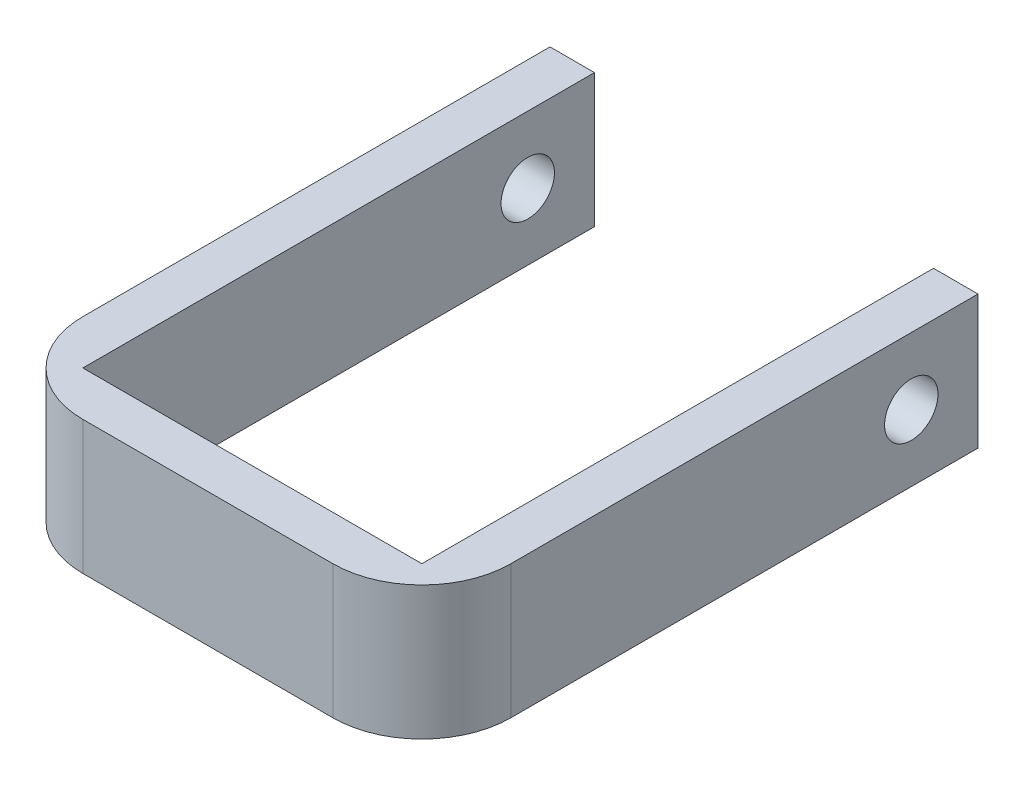
ISO-10303-21;
HEADER;
FILE_DESCRIPTION(('STEP AP214'),'2;1');
FILE_NAME('part.step','',(''),(''),'','','');
FILE_SCHEMA(('AUTOMOTIVE_DESIGN { 1 0 10303 214 1 1 1 1 }'));
ENDSEC;
DATA;
#1=APPLICATION_CONTEXT('core data for automotive mechanical design processes');
#2=APPLICATION_PROTOCOL_DEFINITION('international standard','automotive_design',2000,#1);
#3=PRODUCT_CONTEXT('',#1,'mechanical');
#4=PRODUCT('Part','Part','',(#3));
#5=PRODUCT_RELATED_PRODUCT_CATEGORY('part','',(#4));
#6=PRODUCT_DEFINITION_FORMATION('','',#4);
#7=PRODUCT_DEFINITION_CONTEXT('part definition',#1,'design');
#8=PRODUCT_DEFINITION('design','',#6,#7);
#9=PRODUCT_DEFINITION_SHAPE('','',#8);
#10=(LENGTH_UNIT() NAMED_UNIT(*) SI_UNIT(.MILLI.,.METRE.));
#11=(NAMED_UNIT(*) PLANE_ANGLE_UNIT() SI_UNIT($,.RADIAN.));
#12=(NAMED_UNIT(*) SI_UNIT($,.STERADIAN.) SOLID_ANGLE_UNIT());
#13=UNCERTAINTY_MEASURE_WITH_UNIT(LENGTH_MEASURE(1.E-05),#10,'distance_accuracy_value','');
#14=(GEOMETRIC_REPRESENTATION_CONTEXT(3) GLOBAL_UNCERTAINTY_ASSIGNED_CONTEXT((#13)) GLOBAL_UNIT_ASSIGNED_CONTEXT((#10,
#11,#12)) REPRESENTATION_CONTEXT('',''));
#15=CARTESIAN_POINT('',(0.,0.,0.));
#16=DIRECTION('',(0.,0.,1.));
#17=DIRECTION('',(1.,0.,0.));
#18=AXIS2_PLACEMENT_3D('',#15,#16,#17);
#19=CARTESIAN_POINT('',(0.,30.,0.));
#20=DIRECTION('',(-1.,0.,0.));
#21=DIRECTION('',(0.,0.,1.));
#22=AXIS2_PLACEMENT_3D('',#19,#20,#21);
#23=PLANE('',#22);
#24=CARTESIAN_POINT('',(0.,15.,-100.));
#25=DIRECTION('',(-1.,0.,0.));
#26=DIRECTION('',(0.,0.,1.));
#27=AXIS2_PLACEMENT_3D('',#24,#25,#26);
#28=CIRCLE('',#27,6.);
#29=CARTESIAN_POINT('',(0.,15.,-94.));
#30=VERTEX_POINT('',#29);
#31=EDGE_CURVE('E226',#30,#30,#28,.T.);
#32=ORIENTED_EDGE('',*,*,#31,.T.);
#33=EDGE_LOOP('',(#32));
#34=FACE_BOUND('',#33,.T.);
#35=DIRECTION('',(0.,0.,-1.));
#36=VECTOR('',#35,1.);
#37=CARTESIAN_POINT('',(0.,0.,0.));
#38=LINE('',#37,#36);
#39=CARTESIAN_POINT('',(0.,0.,0.));
#40=VERTEX_POINT('',#39);
#41=CARTESIAN_POINT('',(0.,0.,-115.));
#42=VERTEX_POINT('',#41);
#43=EDGE_CURVE('E149',#40,#42,#38,.T.);
#44=ORIENTED_EDGE('',*,*,#43,.T.);
#45=DIRECTION('',(0.,-1.,0.));
#46=VECTOR('',#45,1.);
#47=CARTESIAN_POINT('',(0.,30.,-115.));
#48=LINE('',#47,#46);
#49=CARTESIAN_POINT('',(0.,30.,-115.));
#50=VERTEX_POINT('',#49);
#51=EDGE_CURVE('E131',#50,#42,#48,.T.);
#52=ORIENTED_EDGE('',*,*,#51,.F.);
#53=DIRECTION('',(0.,0.,-1.));
#54=VECTOR('',#53,1.);
#55=CARTESIAN_POINT('',(0.,30.,0.));
#56=LINE('',#55,#54);
#57=CARTESIAN_POINT('',(0.,30.,0.));
#58=VERTEX_POINT('',#57);
#59=EDGE_CURVE('E137',#58,#50,#56,.T.);
#60=ORIENTED_EDGE('',*,*,#59,.F.);
#61=DIRECTION('',(0.,-1.,0.));
#62=VECTOR('',#61,1.);
#63=CARTESIAN_POINT('',(0.,30.,0.));
#64=LINE('',#63,#62);
#65=EDGE_CURVE('E203',#58,#40,#64,.T.);
#66=ORIENTED_EDGE('',*,*,#65,.T.);
#67=EDGE_LOOP('',(#44,#52,#60,#66));
#68=FACE_BOUND('',#67,.T.);
#69=ADVANCED_FACE('F47',(#34,#68),#23,.F.);
#70=CARTESIAN_POINT('',(0.,30.,-115.));
#71=DIRECTION('',(0.,0.,1.));
#72=DIRECTION('',(1.,0.,0.));
#73=AXIS2_PLACEMENT_3D('',#70,#71,#72);
#74=PLANE('',#73);
#75=DIRECTION('',(-1.,0.,0.));
#76=VECTOR('',#75,1.);
#77=CARTESIAN_POINT('',(0.,0.,-115.));
#78=LINE('',#77,#76);
#79=CARTESIAN_POINT('',(-10.,0.,-115.));
#80=VERTEX_POINT('',#79);
#81=EDGE_CURVE('E195',#42,#80,#78,.T.);
#82=ORIENTED_EDGE('',*,*,#81,.T.);
#83=DIRECTION('',(0.,-1.,0.));
#84=VECTOR('',#83,1.);
#85=CARTESIAN_POINT('',(-10.,30.,-115.));
#86=LINE('',#85,#84);
#87=CARTESIAN_POINT('',(-10.,30.,-115.));
#88=VERTEX_POINT('',#87);
#89=EDGE_CURVE('E134',#88,#80,#86,.T.);
#90=ORIENTED_EDGE('',*,*,#89,.F.);
#91=DIRECTION('',(-1.,0.,0.));
#92=VECTOR('',#91,1.);
#93=CARTESIAN_POINT('',(0.,30.,-115.));
#94=LINE('',#93,#92);
#95=EDGE_CURVE('E127',#50,#88,#94,.T.);
#96=ORIENTED_EDGE('',*,*,#95,.F.);
#97=ORIENTED_EDGE('',*,*,#51,.T.);
#98=EDGE_LOOP('',(#82,#90,#96,#97));
#99=FACE_BOUND('',#98,.T.);
#100=ADVANCED_FACE('F129',(#99),#74,.F.);
#101=CARTESIAN_POINT('',(-10.,30.,-115.));
#102=DIRECTION('',(1.,0.,0.));
#103=DIRECTION('',(0.,0.,-1.));
#104=AXIS2_PLACEMENT_3D('',#101,#102,#103);
#105=PLANE('',#104);
#106=CARTESIAN_POINT('',(-9.99999999999999,15.,-100.));
#107=DIRECTION('',(1.,0.,0.));
#108=DIRECTION('',(0.,0.,-1.));
#109=AXIS2_PLACEMENT_3D('',#106,#107,#108);
#110=CIRCLE('',#109,6.);
#111=CARTESIAN_POINT('',(-9.99999999999999,15.,-106.));
#112=VERTEX_POINT('',#111);
#113=EDGE_CURVE('E239',#112,#112,#110,.T.);
#114=ORIENTED_EDGE('',*,*,#113,.T.);
#115=EDGE_LOOP('',(#114));
#116=FACE_BOUND('',#115,.T.);
#117=DIRECTION('',(0.,0.,1.));
#118=VECTOR('',#117,1.);
#119=CARTESIAN_POINT('',(-10.,0.,-115.));
#120=LINE('',#119,#118);
#121=CARTESIAN_POINT('',(-9.99999999999999,0.,-9.99999999999999));
#122=VERTEX_POINT('',#121);
#123=EDGE_CURVE('E191',#80,#122,#120,.T.);
#124=ORIENTED_EDGE('',*,*,#123,.T.);
#125=DIRECTION('',(0.,-1.,0.));
#126=VECTOR('',#125,1.);
#127=CARTESIAN_POINT('',(-9.99999999999999,30.,-9.99999999999999));
#128=LINE('',#127,#126);
#129=CARTESIAN_POINT('',(-9.99999999999999,30.,-9.99999999999999));
#130=VERTEX_POINT('',#129);
#131=EDGE_CURVE('E11',#122,#130,#128,.F.);
#132=ORIENTED_EDGE('',*,*,#131,.T.);
#133=DIRECTION('',(0.,0.,1.));
#134=VECTOR('',#133,1.);
#135=CARTESIAN_POINT('',(-10.,30.,-115.));
#136=LINE('',#135,#134);
#137=EDGE_CURVE('E136',#88,#130,#136,.T.);
#138=ORIENTED_EDGE('',*,*,#137,.F.);
#139=ORIENTED_EDGE('',*,*,#89,.T.);
#140=EDGE_LOOP('',(#124,#132,#138,#139));
#141=FACE_BOUND('',#140,.T.);
#142=ADVANCED_FACE('F228',(#116,#141),#105,.F.);
#143=CARTESIAN_POINT('',(-9.99999999999999,30.,9.99999999999999));
#144=DIRECTION('',(0.,0.,-1.));
#145=DIRECTION('',(-1.,0.,0.));
#146=AXIS2_PLACEMENT_3D('',#143,#144,#145);
#147=PLANE('',#146);
#148=DIRECTION('',(1.,0.,0.));
#149=VECTOR('',#148,1.);
#150=CARTESIAN_POINT('',(-9.99999999999999,0.,9.99999999999999));
#151=LINE('',#150,#149);
#152=CARTESIAN_POINT('',(10.,0.,10.));
#153=VERTEX_POINT('',#152);
#154=CARTESIAN_POINT('',(66.2,0.,10.));
#155=VERTEX_POINT('',#154);
#156=EDGE_CURVE('E186',#153,#155,#151,.T.);
#157=ORIENTED_EDGE('',*,*,#156,.T.);
#158=DIRECTION('',(0.,-1.,0.));
#159=VECTOR('',#158,1.);
#160=CARTESIAN_POINT('',(66.2,30.,10.));
#161=LINE('',#160,#159);
#162=CARTESIAN_POINT('',(66.2,30.,10.));
#163=VERTEX_POINT('',#162);
#164=EDGE_CURVE('E69',#155,#163,#161,.F.);
#165=ORIENTED_EDGE('',*,*,#164,.T.);
#166=DIRECTION('',(1.,0.,0.));
#167=VECTOR('',#166,1.);
#168=CARTESIAN_POINT('',(-9.99999999999999,30.,9.99999999999999));
#169=LINE('',#168,#167);
#170=CARTESIAN_POINT('',(10.,30.,10.));
#171=VERTEX_POINT('',#170);
#172=EDGE_CURVE('E172',#171,#163,#169,.T.);
#173=ORIENTED_EDGE('',*,*,#172,.F.);
#174=DIRECTION('',(0.,-1.,0.));
#175=VECTOR('',#174,1.);
#176=CARTESIAN_POINT('',(10.,30.,10.));
#177=LINE('',#176,#175);
#178=EDGE_CURVE('E162',#171,#153,#177,.T.);
#179=ORIENTED_EDGE('',*,*,#178,.T.);
#180=EDGE_LOOP('',(#157,#165,#173,#179));
#181=FACE_BOUND('',#180,.T.);
#182=ADVANCED_FACE('F189',(#181),#147,.F.);
#183=CARTESIAN_POINT('',(86.2,30.,10.));
#184=DIRECTION('',(-1.,0.,0.));
#185=DIRECTION('',(0.,0.,1.));
#186=AXIS2_PLACEMENT_3D('',#183,#184,#185);
#187=PLANE('',#186);
#188=CARTESIAN_POINT('',(86.2,15.,-100.));
#189=DIRECTION('',(1.,0.,0.));
#190=DIRECTION('',(0.,0.,-1.));
#191=AXIS2_PLACEMENT_3D('',#188,#189,#190);
#192=CIRCLE('',#191,6.);
#193=CARTESIAN_POINT('',(86.2,15.,-106.));
#194=VERTEX_POINT('',#193);
#195=EDGE_CURVE('E236',#194,#194,#192,.T.);
#196=ORIENTED_EDGE('',*,*,#195,.F.);
#197=EDGE_LOOP('',(#196));
#198=FACE_BOUND('',#197,.T.);
#199=DIRECTION('',(0.,0.,-1.));
#200=VECTOR('',#199,1.);
#201=CARTESIAN_POINT('',(86.2,30.,10.));
#202=LINE('',#201,#200);
#203=CARTESIAN_POINT('',(86.2,30.,-10.));
#204=VERTEX_POINT('',#203);
#205=CARTESIAN_POINT('',(86.2,30.,-115.));
#206=VERTEX_POINT('',#205);
#207=EDGE_CURVE('E170',#204,#206,#202,.T.);
#208=ORIENTED_EDGE('',*,*,#207,.F.);
#209=DIRECTION('',(0.,-1.,0.));
#210=VECTOR('',#209,1.);
#211=CARTESIAN_POINT('',(86.2,30.,-10.));
#212=LINE('',#211,#210);
#213=CARTESIAN_POINT('',(86.2,0.,-10.));
#214=VERTEX_POINT('',#213);
#215=EDGE_CURVE('E150',#204,#214,#212,.T.);
#216=ORIENTED_EDGE('',*,*,#215,.T.);
#217=DIRECTION('',(0.,0.,-1.));
#218=VECTOR('',#217,1.);
#219=CARTESIAN_POINT('',(86.2,0.,10.));
#220=LINE('',#219,#218);
#221=CARTESIAN_POINT('',(86.2,0.,-115.));
#222=VERTEX_POINT('',#221);
#223=EDGE_CURVE('E188',#214,#222,#220,.T.);
#224=ORIENTED_EDGE('',*,*,#223,.T.);
#225=DIRECTION('',(0.,-1.,0.));
#226=VECTOR('',#225,1.);
#227=CARTESIAN_POINT('',(86.2,30.,-115.));
#228=LINE('',#227,#226);
#229=EDGE_CURVE('E155',#206,#222,#228,.T.);
#230=ORIENTED_EDGE('',*,*,#229,.F.);
#231=EDGE_LOOP('',(#208,#216,#224,#230));
#232=FACE_BOUND('',#231,.T.);
#233=ADVANCED_FACE('F176',(#198,#232),#187,.F.);
#234=CARTESIAN_POINT('',(86.2,30.,-115.));
#235=DIRECTION('',(0.,0.,1.));
#236=DIRECTION('',(1.,0.,0.));
#237=AXIS2_PLACEMENT_3D('',#234,#235,#236);
#238=PLANE('',#237);
#239=DIRECTION('',(-1.,0.,0.));
#240=VECTOR('',#239,1.);
#241=CARTESIAN_POINT('',(86.2,0.,-115.));
#242=LINE('',#241,#240);
#243=CARTESIAN_POINT('',(76.2,0.,-115.));
#244=VERTEX_POINT('',#243);
#245=EDGE_CURVE('E193',#222,#244,#242,.T.);
#246=ORIENTED_EDGE('',*,*,#245,.T.);
#247=DIRECTION('',(0.,-1.,0.));
#248=VECTOR('',#247,1.);
#249=CARTESIAN_POINT('',(76.2,30.,-115.));
#250=LINE('',#249,#248);
#251=CARTESIAN_POINT('',(76.2,30.,-115.));
#252=VERTEX_POINT('',#251);
#253=EDGE_CURVE('E208',#252,#244,#250,.T.);
#254=ORIENTED_EDGE('',*,*,#253,.F.);
#255=DIRECTION('',(-1.,0.,0.));
#256=VECTOR('',#255,1.);
#257=CARTESIAN_POINT('',(86.2,30.,-115.));
#258=LINE('',#257,#256);
#259=EDGE_CURVE('E180',#206,#252,#258,.T.);
#260=ORIENTED_EDGE('',*,*,#259,.F.);
#261=ORIENTED_EDGE('',*,*,#229,.T.);
#262=EDGE_LOOP('',(#246,#254,#260,#261));
#263=FACE_BOUND('',#262,.T.);
#264=ADVANCED_FACE('F211',(#263),#238,.F.);
#265=CARTESIAN_POINT('',(76.2,30.,0.));
#266=DIRECTION('',(1.,0.,0.));
#267=DIRECTION('',(0.,0.,-1.));
#268=AXIS2_PLACEMENT_3D('',#265,#266,#267);
#269=PLANE('',#268);
#270=CARTESIAN_POINT('',(76.2,15.,-100.));
#271=DIRECTION('',(1.,0.,0.));
#272=DIRECTION('',(0.,0.,-1.));
#273=AXIS2_PLACEMENT_3D('',#270,#271,#272);
#274=CIRCLE('',#273,6.);
#275=CARTESIAN_POINT('',(76.2,15.,-106.));
#276=VERTEX_POINT('',#275);
#277=EDGE_CURVE('E51',#276,#276,#274,.T.);
#278=ORIENTED_EDGE('',*,*,#277,.T.);
#279=EDGE_LOOP('',(#278));
#280=FACE_BOUND('',#279,.T.);
#281=DIRECTION('',(0.,0.,1.));
#282=VECTOR('',#281,1.);
#283=CARTESIAN_POINT('',(76.2,0.,0.));
#284=LINE('',#283,#282);
#285=CARTESIAN_POINT('',(76.2,0.,0.));
#286=VERTEX_POINT('',#285);
#287=EDGE_CURVE('E200',#244,#286,#284,.T.);
#288=ORIENTED_EDGE('',*,*,#287,.T.);
#289=DIRECTION('',(0.,-1.,0.));
#290=VECTOR('',#289,1.);
#291=CARTESIAN_POINT('',(76.2,30.,0.));
#292=LINE('',#291,#290);
#293=CARTESIAN_POINT('',(76.2,30.,0.));
#294=VERTEX_POINT('',#293);
#295=EDGE_CURVE('E205',#294,#286,#292,.T.);
#296=ORIENTED_EDGE('',*,*,#295,.F.);
#297=DIRECTION('',(0.,0.,1.));
#298=VECTOR('',#297,1.);
#299=CARTESIAN_POINT('',(76.2,30.,0.));
#300=LINE('',#299,#298);
#301=EDGE_CURVE('E221',#252,#294,#300,.T.);
#302=ORIENTED_EDGE('',*,*,#301,.F.);
#303=ORIENTED_EDGE('',*,*,#253,.T.);
#304=EDGE_LOOP('',(#288,#296,#302,#303));
#305=FACE_BOUND('',#304,.T.);
#306=ADVANCED_FACE('F217',(#280,#305),#269,.F.);
#307=CARTESIAN_POINT('',(0.,30.,0.));
#308=DIRECTION('',(0.,0.,1.));
#309=DIRECTION('',(1.,0.,0.));
#310=AXIS2_PLACEMENT_3D('',#307,#308,#309);
#311=PLANE('',#310);
#312=DIRECTION('',(-1.,0.,0.));
#313=VECTOR('',#312,1.);
#314=CARTESIAN_POINT('',(0.,0.,0.));
#315=LINE('',#314,#313);
#316=EDGE_CURVE('E146',#286,#40,#315,.T.);
#317=ORIENTED_EDGE('',*,*,#316,.T.);
#318=ORIENTED_EDGE('',*,*,#65,.F.);
#319=DIRECTION('',(-1.,0.,0.));
#320=VECTOR('',#319,1.);
#321=CARTESIAN_POINT('',(0.,30.,0.));
#322=LINE('',#321,#320);
#323=EDGE_CURVE('E142',#294,#58,#322,.T.);
#324=ORIENTED_EDGE('',*,*,#323,.F.);
#325=ORIENTED_EDGE('',*,*,#295,.T.);
#326=EDGE_LOOP('',(#317,#318,#324,#325));
#327=FACE_BOUND('',#326,.T.);
#328=ADVANCED_FACE('F220',(#327),#311,.F.);
#329=CARTESIAN_POINT('',(0.,30.,0.));
#330=DIRECTION('',(0.,1.,0.));
#331=DIRECTION('',(0.,0.,1.));
#332=AXIS2_PLACEMENT_3D('',#329,#330,#331);
#333=PLANE('',#332);
#334=ORIENTED_EDGE('',*,*,#172,.T.);
#335=CARTESIAN_POINT('',(66.2,30.,-10.));
#336=DIRECTION('',(0.,1.,0.));
#337=DIRECTION('',(0.,0.,1.));
#338=AXIS2_PLACEMENT_3D('',#335,#336,#337);
#339=CIRCLE('',#338,20.);
#340=EDGE_CURVE('E56',#163,#204,#339,.T.);
#341=ORIENTED_EDGE('',*,*,#340,.T.);
#342=ORIENTED_EDGE('',*,*,#207,.T.);
#343=ORIENTED_EDGE('',*,*,#259,.T.);
#344=ORIENTED_EDGE('',*,*,#301,.T.);
#345=ORIENTED_EDGE('',*,*,#323,.T.);
#346=ORIENTED_EDGE('',*,*,#59,.T.);
#347=ORIENTED_EDGE('',*,*,#95,.T.);
#348=ORIENTED_EDGE('',*,*,#137,.T.);
#349=CARTESIAN_POINT('',(10.,30.,-10.));
#350=DIRECTION('',(0.,1.,0.));
#351=DIRECTION('',(0.,0.,1.));
#352=AXIS2_PLACEMENT_3D('',#349,#350,#351);
#353=CIRCLE('',#352,20.);
#354=EDGE_CURVE('E166',#130,#171,#353,.T.);
#355=ORIENTED_EDGE('',*,*,#354,.T.);
#356=EDGE_LOOP('',(#334,#341,#342,#343,#344,#345,#346,#347,#348,#355));
#357=FACE_BOUND('',#356,.T.);
#358=ADVANCED_FACE('F140',(#357),#333,.T.);
#359=CARTESIAN_POINT('',(0.,0.,0.));
#360=DIRECTION('',(0.,1.,0.));
#361=DIRECTION('',(0.,0.,1.));
#362=AXIS2_PLACEMENT_3D('',#359,#360,#361);
#363=PLANE('',#362);
#364=ORIENTED_EDGE('',*,*,#223,.F.);
#365=CARTESIAN_POINT('',(66.2,0.,-10.));
#366=DIRECTION('',(0.,1.,0.));
#367=DIRECTION('',(0.,0.,1.));
#368=AXIS2_PLACEMENT_3D('',#365,#366,#367);
#369=CIRCLE('',#368,20.);
#370=EDGE_CURVE('E160',#214,#155,#369,.F.);
#371=ORIENTED_EDGE('',*,*,#370,.T.);
#372=ORIENTED_EDGE('',*,*,#156,.F.);
#373=CARTESIAN_POINT('',(10.,0.,-10.));
#374=DIRECTION('',(0.,1.,0.));
#375=DIRECTION('',(0.,0.,1.));
#376=AXIS2_PLACEMENT_3D('',#373,#374,#375);
#377=CIRCLE('',#376,20.);
#378=EDGE_CURVE('E153',#153,#122,#377,.F.);
#379=ORIENTED_EDGE('',*,*,#378,.T.);
#380=ORIENTED_EDGE('',*,*,#123,.F.);
#381=ORIENTED_EDGE('',*,*,#81,.F.);
#382=ORIENTED_EDGE('',*,*,#43,.F.);
#383=ORIENTED_EDGE('',*,*,#316,.F.);
#384=ORIENTED_EDGE('',*,*,#287,.F.);
#385=ORIENTED_EDGE('',*,*,#245,.F.);
#386=EDGE_LOOP('',(#364,#371,#372,#379,#380,#381,#382,#383,#384,#385));
#387=FACE_BOUND('',#386,.T.);
#388=ADVANCED_FACE('F185',(#387),#363,.F.);
#389=CARTESIAN_POINT('',(66.2,30.,-10.));
#390=DIRECTION('',(0.,-1.,0.));
#391=DIRECTION('',(0.,0.,-1.));
#392=AXIS2_PLACEMENT_3D('',#389,#390,#391);
#393=CYLINDRICAL_SURFACE('',#392,20.);
#394=ORIENTED_EDGE('',*,*,#340,.F.);
#395=ORIENTED_EDGE('',*,*,#164,.F.);
#396=ORIENTED_EDGE('',*,*,#370,.F.);
#397=ORIENTED_EDGE('',*,*,#215,.F.);
#398=EDGE_LOOP('',(#394,#395,#396,#397));
#399=FACE_BOUND('',#398,.T.);
#400=ADVANCED_FACE('F182',(#399),#393,.T.);
#401=CARTESIAN_POINT('',(10.,30.,-10.));
#402=DIRECTION('',(0.,-1.,0.));
#403=DIRECTION('',(0.,0.,-1.));
#404=AXIS2_PLACEMENT_3D('',#401,#402,#403);
#405=CYLINDRICAL_SURFACE('',#404,20.);
#406=ORIENTED_EDGE('',*,*,#354,.F.);
#407=ORIENTED_EDGE('',*,*,#131,.F.);
#408=ORIENTED_EDGE('',*,*,#378,.F.);
#409=ORIENTED_EDGE('',*,*,#178,.F.);
#410=EDGE_LOOP('',(#406,#407,#408,#409));
#411=FACE_BOUND('',#410,.T.);
#412=ADVANCED_FACE('F49',(#411),#405,.T.);
#413=CARTESIAN_POINT('',(-9.99999999999999,15.,-100.));
#414=DIRECTION('',(1.,0.,0.));
#415=DIRECTION('',(0.,0.,-1.));
#416=AXIS2_PLACEMENT_3D('',#413,#414,#415);
#417=CYLINDRICAL_SURFACE('',#416,6.);
#418=ORIENTED_EDGE('',*,*,#195,.T.);
#419=EDGE_LOOP('',(#418));
#420=FACE_BOUND('',#419,.T.);
#421=ORIENTED_EDGE('',*,*,#277,.F.);
#422=EDGE_LOOP('',(#421));
#423=FACE_BOUND('',#422,.T.);
#424=ADVANCED_FACE('F247',(#420,#423),#417,.F.);
#425=ORIENTED_EDGE('',*,*,#113,.F.);
#426=EDGE_LOOP('',(#425));
#427=FACE_BOUND('',#426,.T.);
#428=ORIENTED_EDGE('',*,*,#31,.F.);
#429=EDGE_LOOP('',(#428));
#430=FACE_BOUND('',#429,.T.);
#431=ADVANCED_FACE('F249',(#427,#430),#417,.F.);
#432=CLOSED_SHELL('',(#69,#100,#142,#182,#233,#264,#306,#328,#358,#388,#400,#412,#424,#431));
#433=MANIFOLD_SOLID_BREP('B2',#432);
#434=ADVANCED_BREP_SHAPE_REPRESENTATION('',(#18,#433),#14);
#435=SHAPE_DEFINITION_REPRESENTATION(#9,#434);
ENDSEC;
END-ISO-10303-21;
